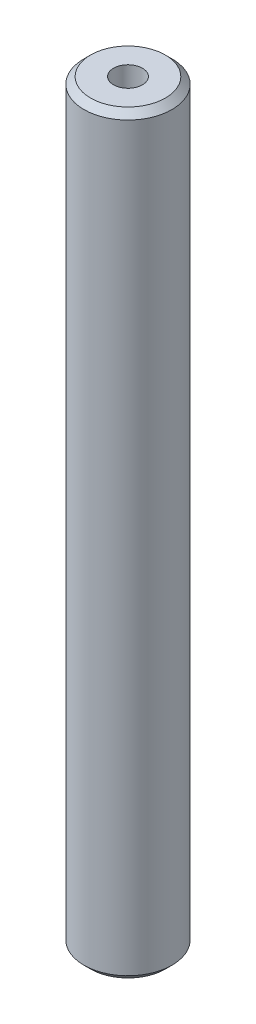
ISO-10303-21;
HEADER;
FILE_DESCRIPTION(('STEP AP214'),'2;1');
FILE_NAME('part.step','',(''),(''),'','','');
FILE_SCHEMA(('AUTOMOTIVE_DESIGN { 1 0 10303 214 1 1 1 1 }'));
ENDSEC;
DATA;
#1=APPLICATION_CONTEXT('core data for automotive mechanical design processes');
#2=APPLICATION_PROTOCOL_DEFINITION('international standard','automotive_design',2000,#1);
#3=PRODUCT_CONTEXT('',#1,'mechanical');
#4=PRODUCT('Part','Part','',(#3));
#5=PRODUCT_RELATED_PRODUCT_CATEGORY('part','',(#4));
#6=PRODUCT_DEFINITION_FORMATION('','',#4);
#7=PRODUCT_DEFINITION_CONTEXT('part definition',#1,'design');
#8=PRODUCT_DEFINITION('design','',#6,#7);
#9=PRODUCT_DEFINITION_SHAPE('','',#8);
#10=(LENGTH_UNIT() NAMED_UNIT(*) SI_UNIT(.MILLI.,.METRE.));
#11=(NAMED_UNIT(*) PLANE_ANGLE_UNIT() SI_UNIT($,.RADIAN.));
#12=(NAMED_UNIT(*) SI_UNIT($,.STERADIAN.) SOLID_ANGLE_UNIT());
#13=UNCERTAINTY_MEASURE_WITH_UNIT(LENGTH_MEASURE(1.E-05),#10,'distance_accuracy_value','');
#14=(GEOMETRIC_REPRESENTATION_CONTEXT(3) GLOBAL_UNCERTAINTY_ASSIGNED_CONTEXT((#13)) GLOBAL_UNIT_ASSIGNED_CONTEXT((#10,
#11,#12)) REPRESENTATION_CONTEXT('',''));
#15=CARTESIAN_POINT('',(0.,0.,0.));
#16=DIRECTION('',(0.,0.,1.));
#17=DIRECTION('',(1.,0.,0.));
#18=AXIS2_PLACEMENT_3D('',#15,#16,#17);
#19=CARTESIAN_POINT('',(0.,600.,0.));
#20=DIRECTION('',(0.,-1.,0.));
#21=DIRECTION('',(0.,0.,-1.));
#22=AXIS2_PLACEMENT_3D('',#19,#20,#21);
#23=CYLINDRICAL_SURFACE('',#22,35.);
#24=CARTESIAN_POINT('',(0.,594.727588414193,0.));
#25=DIRECTION('',(0.,1.,0.));
#26=DIRECTION('',(0.,0.,1.));
#27=AXIS2_PLACEMENT_3D('',#24,#25,#26);
#28=CIRCLE('',#27,35.);
#29=CARTESIAN_POINT('',(0.,594.727588414193,35.));
#30=VERTEX_POINT('',#29);
#31=EDGE_CURVE('E50',#30,#30,#28,.F.);
#32=ORIENTED_EDGE('',*,*,#31,.T.);
#33=EDGE_LOOP('',(#32));
#34=FACE_BOUND('',#33,.T.);
#35=CARTESIAN_POINT('',(0.,5.27241158580738,0.));
#36=DIRECTION('',(0.,1.,0.));
#37=DIRECTION('',(0.,0.,1.));
#38=AXIS2_PLACEMENT_3D('',#35,#36,#37);
#39=CIRCLE('',#38,35.);
#40=CARTESIAN_POINT('',(0.,5.27241158580738,35.));
#41=VERTEX_POINT('',#40);
#42=EDGE_CURVE('E51',#41,#41,#39,.T.);
#43=ORIENTED_EDGE('',*,*,#42,.T.);
#44=EDGE_LOOP('',(#43));
#45=FACE_BOUND('',#44,.T.);
#46=ADVANCED_FACE('F39',(#34,#45),#23,.T.);
#47=CARTESIAN_POINT('',(0.,600.,0.));
#48=DIRECTION('',(0.,1.,0.));
#49=DIRECTION('',(0.,0.,1.));
#50=AXIS2_PLACEMENT_3D('',#47,#48,#49);
#51=PLANE('',#50);
#52=CARTESIAN_POINT('',(0.,600.,0.));
#53=DIRECTION('',(0.,1.,0.));
#54=DIRECTION('',(0.,0.,1.));
#55=AXIS2_PLACEMENT_3D('',#52,#53,#54);
#56=CIRCLE('',#55,29.7275884141926);
#57=CARTESIAN_POINT('',(0.,600.,29.7275884141926));
#58=VERTEX_POINT('',#57);
#59=EDGE_CURVE('E54',#58,#58,#56,.T.);
#60=ORIENTED_EDGE('',*,*,#59,.T.);
#61=EDGE_LOOP('',(#60));
#62=FACE_BOUND('',#61,.T.);
#63=CARTESIAN_POINT('',(0.,600.,0.));
#64=DIRECTION('',(0.,1.,0.));
#65=DIRECTION('',(0.,0.,1.));
#66=AXIS2_PLACEMENT_3D('',#63,#64,#65);
#67=CIRCLE('',#66,11.4889498540615);
#68=CARTESIAN_POINT('',(0.,600.,11.4889498540615));
#69=VERTEX_POINT('',#68);
#70=EDGE_CURVE('E58',#69,#69,#67,.T.);
#71=ORIENTED_EDGE('',*,*,#70,.F.);
#72=EDGE_LOOP('',(#71));
#73=FACE_BOUND('',#72,.T.);
#74=ADVANCED_FACE('F69',(#62,#73),#51,.T.);
#75=CARTESIAN_POINT('',(0.,0.,0.));
#76=DIRECTION('',(0.,1.,0.));
#77=DIRECTION('',(0.,0.,1.));
#78=AXIS2_PLACEMENT_3D('',#75,#76,#77);
#79=PLANE('',#78);
#80=CARTESIAN_POINT('',(0.,0.,0.));
#81=DIRECTION('',(0.,1.,0.));
#82=DIRECTION('',(0.,0.,1.));
#83=AXIS2_PLACEMENT_3D('',#80,#81,#82);
#84=CIRCLE('',#83,29.7275884141926);
#85=CARTESIAN_POINT('',(0.,0.,29.7275884141926));
#86=VERTEX_POINT('',#85);
#87=EDGE_CURVE('E10',#86,#86,#84,.F.);
#88=ORIENTED_EDGE('',*,*,#87,.T.);
#89=EDGE_LOOP('',(#88));
#90=FACE_BOUND('',#89,.T.);
#91=CARTESIAN_POINT('',(0.,0.,0.));
#92=DIRECTION('',(0.,1.,0.));
#93=DIRECTION('',(0.,0.,1.));
#94=AXIS2_PLACEMENT_3D('',#91,#92,#93);
#95=CIRCLE('',#94,11.4889498540615);
#96=CARTESIAN_POINT('',(0.,0.,11.4889498540615));
#97=VERTEX_POINT('',#96);
#98=EDGE_CURVE('E63',#97,#97,#95,.T.);
#99=ORIENTED_EDGE('',*,*,#98,.T.);
#100=EDGE_LOOP('',(#99));
#101=FACE_BOUND('',#100,.T.);
#102=ADVANCED_FACE('F75',(#90,#101),#79,.F.);
#103=CARTESIAN_POINT('',(0.,600.,0.));
#104=DIRECTION('',(0.,-1.,0.));
#105=DIRECTION('',(0.,0.,-1.));
#106=AXIS2_PLACEMENT_3D('',#103,#104,#105);
#107=CYLINDRICAL_SURFACE('',#106,11.4889498540615);
#108=ORIENTED_EDGE('',*,*,#70,.T.);
#109=EDGE_LOOP('',(#108));
#110=FACE_BOUND('',#109,.T.);
#111=ORIENTED_EDGE('',*,*,#98,.F.);
#112=EDGE_LOOP('',(#111));
#113=FACE_BOUND('',#112,.T.);
#114=ADVANCED_FACE('F70',(#110,#113),#107,.F.);
#115=CARTESIAN_POINT('',(0.,600.,0.));
#116=DIRECTION('',(0.,-1.,0.));
#117=DIRECTION('',(0.,0.,-1.));
#118=AXIS2_PLACEMENT_3D('',#115,#116,#117);
#119=CONICAL_SURFACE('',#118,29.7275884141926,0.785398163397452);
#120=ORIENTED_EDGE('',*,*,#31,.F.);
#121=EDGE_LOOP('',(#120));
#122=FACE_BOUND('',#121,.T.);
#123=ORIENTED_EDGE('',*,*,#59,.F.);
#124=EDGE_LOOP('',(#123));
#125=FACE_BOUND('',#124,.T.);
#126=ADVANCED_FACE('F81',(#122,#125),#119,.T.);
#127=CARTESIAN_POINT('',(0.,5.27241158580738,0.));
#128=DIRECTION('',(0.,1.,0.));
#129=DIRECTION('',(0.,0.,1.));
#130=AXIS2_PLACEMENT_3D('',#127,#128,#129);
#131=CONICAL_SURFACE('',#130,35.,0.785398163397452);
#132=ORIENTED_EDGE('',*,*,#87,.F.);
#133=EDGE_LOOP('',(#132));
#134=FACE_BOUND('',#133,.T.);
#135=ORIENTED_EDGE('',*,*,#42,.F.);
#136=EDGE_LOOP('',(#135));
#137=FACE_BOUND('',#136,.T.);
#138=ADVANCED_FACE('F45',(#134,#137),#131,.T.);
#139=CLOSED_SHELL('',(#46,#74,#102,#114,#126,#138));
#140=MANIFOLD_SOLID_BREP('B2',#139);
#141=ADVANCED_BREP_SHAPE_REPRESENTATION('',(#18,#140),#14);
#142=SHAPE_DEFINITION_REPRESENTATION(#9,#141);
ENDSEC;
END-ISO-10303-21;
